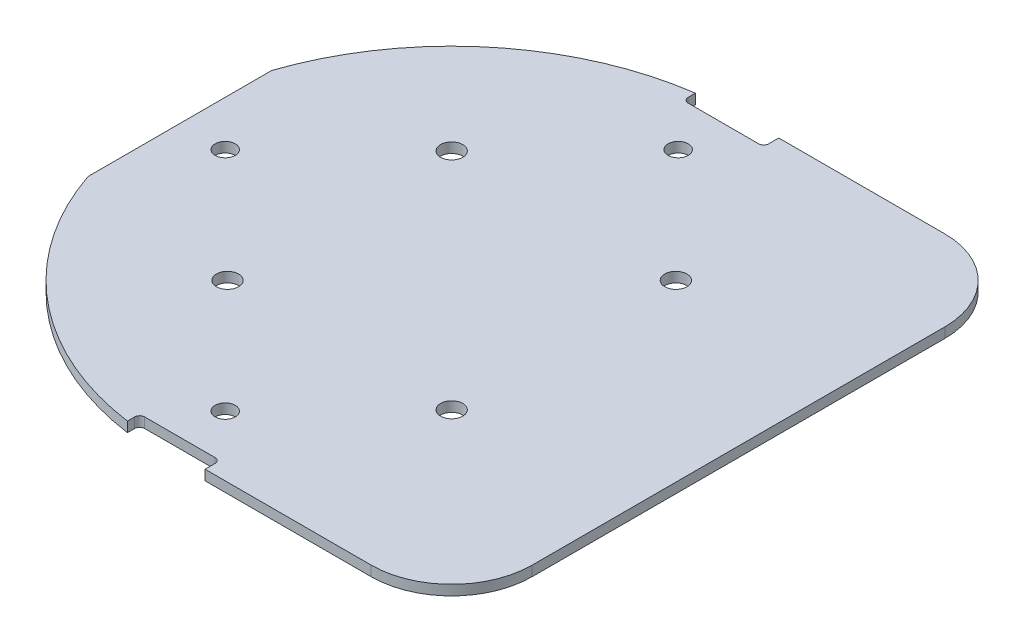
ISO-10303-21;
HEADER;
FILE_DESCRIPTION(('STEP AP214'),'2;1');
FILE_NAME('part.step','',(''),(''),'','','');
FILE_SCHEMA(('AUTOMOTIVE_DESIGN { 1 0 10303 214 1 1 1 1 }'));
ENDSEC;
DATA;
#1=APPLICATION_CONTEXT('core data for automotive mechanical design processes');
#2=APPLICATION_PROTOCOL_DEFINITION('international standard','automotive_design',2000,#1);
#3=PRODUCT_CONTEXT('',#1,'mechanical');
#4=PRODUCT('Part','Part','',(#3));
#5=PRODUCT_RELATED_PRODUCT_CATEGORY('part','',(#4));
#6=PRODUCT_DEFINITION_FORMATION('','',#4);
#7=PRODUCT_DEFINITION_CONTEXT('part definition',#1,'design');
#8=PRODUCT_DEFINITION('design','',#6,#7);
#9=PRODUCT_DEFINITION_SHAPE('','',#8);
#10=(LENGTH_UNIT() NAMED_UNIT(*) SI_UNIT(.MILLI.,.METRE.));
#11=(NAMED_UNIT(*) PLANE_ANGLE_UNIT() SI_UNIT($,.RADIAN.));
#12=(NAMED_UNIT(*) SI_UNIT($,.STERADIAN.) SOLID_ANGLE_UNIT());
#13=UNCERTAINTY_MEASURE_WITH_UNIT(LENGTH_MEASURE(1.E-05),#10,'distance_accuracy_value','');
#14=(GEOMETRIC_REPRESENTATION_CONTEXT(3) GLOBAL_UNCERTAINTY_ASSIGNED_CONTEXT((#13)) GLOBAL_UNIT_ASSIGNED_CONTEXT((#10,
#11,#12)) REPRESENTATION_CONTEXT('',''));
#15=CARTESIAN_POINT('',(0.,0.,0.));
#16=DIRECTION('',(0.,0.,1.));
#17=DIRECTION('',(1.,0.,0.));
#18=AXIS2_PLACEMENT_3D('',#15,#16,#17);
#19=CARTESIAN_POINT('',(0.,1.,28.5));
#20=DIRECTION('',(0.,0.,-1.));
#21=DIRECTION('',(-1.,0.,0.));
#22=AXIS2_PLACEMENT_3D('',#19,#20,#21);
#23=PLANE('',#22);
#24=DIRECTION('',(1.,0.,0.));
#25=VECTOR('',#24,1.);
#26=CARTESIAN_POINT('',(0.,0.,28.5));
#27=LINE('',#26,#25);
#28=CARTESIAN_POINT('',(20.5,0.,28.5));
#29=VERTEX_POINT('',#28);
#30=CARTESIAN_POINT('',(4.,0.,28.5));
#31=VERTEX_POINT('',#30);
#32=EDGE_CURVE('E282',#29,#31,#27,.F.);
#33=ORIENTED_EDGE('',*,*,#32,.F.);
#34=DIRECTION('',(0.,-1.,0.));
#35=VECTOR('',#34,1.);
#36=CARTESIAN_POINT('',(20.5,0.5,28.5));
#37=LINE('',#36,#35);
#38=CARTESIAN_POINT('',(20.5,1.,28.5));
#39=VERTEX_POINT('',#38);
#40=EDGE_CURVE('E134',#39,#29,#37,.T.);
#41=ORIENTED_EDGE('',*,*,#40,.F.);
#42=DIRECTION('',(1.,0.,0.));
#43=VECTOR('',#42,1.);
#44=CARTESIAN_POINT('',(0.,1.,28.5));
#45=LINE('',#44,#43);
#46=CARTESIAN_POINT('',(4.,1.,28.5));
#47=VERTEX_POINT('',#46);
#48=EDGE_CURVE('E183',#47,#39,#45,.T.);
#49=ORIENTED_EDGE('',*,*,#48,.F.);
#50=DIRECTION('',(0.,1.,0.));
#51=VECTOR('',#50,1.);
#52=CARTESIAN_POINT('',(4.,-0.001,28.5));
#53=LINE('',#52,#51);
#54=EDGE_CURVE('E140',#31,#47,#53,.T.);
#55=ORIENTED_EDGE('',*,*,#54,.F.);
#56=EDGE_LOOP('',(#33,#41,#49,#55));
#57=FACE_BOUND('',#56,.T.);
#58=ADVANCED_FACE('F17',(#57),#23,.F.);
#59=CARTESIAN_POINT('',(4.,-0.001,27.));
#60=DIRECTION('',(1.,0.,0.));
#61=DIRECTION('',(0.,0.,-1.));
#62=AXIS2_PLACEMENT_3D('',#59,#60,#61);
#63=PLANE('',#62);
#64=DIRECTION('',(0.,0.,1.));
#65=VECTOR('',#64,1.);
#66=CARTESIAN_POINT('',(4.,0.,0.));
#67=LINE('',#66,#65);
#68=CARTESIAN_POINT('',(4.,0.,27.5));
#69=VERTEX_POINT('',#68);
#70=EDGE_CURVE('E278',#31,#69,#67,.F.);
#71=ORIENTED_EDGE('',*,*,#70,.F.);
#72=ORIENTED_EDGE('',*,*,#54,.T.);
#73=DIRECTION('',(0.,0.,1.));
#74=VECTOR('',#73,1.);
#75=CARTESIAN_POINT('',(4.,1.,0.));
#76=LINE('',#75,#74);
#77=CARTESIAN_POINT('',(4.,1.,27.5));
#78=VERTEX_POINT('',#77);
#79=EDGE_CURVE('E186',#78,#47,#76,.T.);
#80=ORIENTED_EDGE('',*,*,#79,.F.);
#81=DIRECTION('',(0.,1.,0.));
#82=VECTOR('',#81,1.);
#83=CARTESIAN_POINT('',(4.,0.5,27.5));
#84=LINE('',#83,#82);
#85=EDGE_CURVE('E221',#69,#78,#84,.T.);
#86=ORIENTED_EDGE('',*,*,#85,.F.);
#87=EDGE_LOOP('',(#71,#72,#80,#86));
#88=FACE_BOUND('',#87,.T.);
#89=ADVANCED_FACE('F617',(#88),#63,.F.);
#90=CARTESIAN_POINT('',(3.5,1.,27.5));
#91=DIRECTION('',(0.,-1.,0.));
#92=DIRECTION('',(0.,0.,-1.));
#93=AXIS2_PLACEMENT_3D('',#90,#91,#92);
#94=CYLINDRICAL_SURFACE('',#93,0.5);
#95=CARTESIAN_POINT('',(3.5,1.,27.5));
#96=DIRECTION('',(0.,-1.,0.));
#97=DIRECTION('',(0.,0.,-1.));
#98=AXIS2_PLACEMENT_3D('',#95,#96,#97);
#99=CIRCLE('',#98,0.5);
#100=CARTESIAN_POINT('',(3.5,1.,27.));
#101=VERTEX_POINT('',#100);
#102=EDGE_CURVE('E298',#101,#78,#99,.T.);
#103=ORIENTED_EDGE('',*,*,#102,.F.);
#104=DIRECTION('',(0.,1.,0.));
#105=VECTOR('',#104,1.);
#106=CARTESIAN_POINT('',(3.5,-0.001,27.));
#107=LINE('',#106,#105);
#108=CARTESIAN_POINT('',(3.5,0.,27.));
#109=VERTEX_POINT('',#108);
#110=EDGE_CURVE('E219',#109,#101,#107,.T.);
#111=ORIENTED_EDGE('',*,*,#110,.F.);
#112=CARTESIAN_POINT('',(3.5,0.,27.5));
#113=DIRECTION('',(0.,-1.,0.));
#114=DIRECTION('',(0.,0.,-1.));
#115=AXIS2_PLACEMENT_3D('',#112,#113,#114);
#116=CIRCLE('',#115,0.5);
#117=EDGE_CURVE('E275',#69,#109,#116,.F.);
#118=ORIENTED_EDGE('',*,*,#117,.F.);
#119=ORIENTED_EDGE('',*,*,#85,.T.);
#120=EDGE_LOOP('',(#103,#111,#118,#119));
#121=FACE_BOUND('',#120,.T.);
#122=ADVANCED_FACE('F608',(#121),#94,.F.);
#123=CARTESIAN_POINT('',(-4.,-0.001,27.));
#124=DIRECTION('',(0.,0.,-1.));
#125=DIRECTION('',(-1.,0.,0.));
#126=AXIS2_PLACEMENT_3D('',#123,#124,#125);
#127=PLANE('',#126);
#128=DIRECTION('',(1.,0.,0.));
#129=VECTOR('',#128,1.);
#130=CARTESIAN_POINT('',(0.,1.,27.));
#131=LINE('',#130,#129);
#132=CARTESIAN_POINT('',(-3.5,1.,27.));
#133=VERTEX_POINT('',#132);
#134=EDGE_CURVE('E301',#133,#101,#131,.T.);
#135=ORIENTED_EDGE('',*,*,#134,.F.);
#136=DIRECTION('',(0.,1.,0.));
#137=VECTOR('',#136,1.);
#138=CARTESIAN_POINT('',(-3.5,0.5,27.));
#139=LINE('',#138,#137);
#140=CARTESIAN_POINT('',(-3.5,0.,27.));
#141=VERTEX_POINT('',#140);
#142=EDGE_CURVE('E217',#141,#133,#139,.T.);
#143=ORIENTED_EDGE('',*,*,#142,.F.);
#144=DIRECTION('',(1.,0.,0.));
#145=VECTOR('',#144,1.);
#146=CARTESIAN_POINT('',(0.,0.,27.));
#147=LINE('',#146,#145);
#148=EDGE_CURVE('E274',#109,#141,#147,.F.);
#149=ORIENTED_EDGE('',*,*,#148,.F.);
#150=ORIENTED_EDGE('',*,*,#110,.T.);
#151=EDGE_LOOP('',(#135,#143,#149,#150));
#152=FACE_BOUND('',#151,.T.);
#153=ADVANCED_FACE('F599',(#152),#127,.F.);
#154=CARTESIAN_POINT('',(-3.5,1.,27.5));
#155=DIRECTION('',(0.,-1.,0.));
#156=DIRECTION('',(0.,0.,-1.));
#157=AXIS2_PLACEMENT_3D('',#154,#155,#156);
#158=CYLINDRICAL_SURFACE('',#157,0.5);
#159=CARTESIAN_POINT('',(-3.5,1.,27.5));
#160=DIRECTION('',(0.,-1.,0.));
#161=DIRECTION('',(0.,0.,-1.));
#162=AXIS2_PLACEMENT_3D('',#159,#160,#161);
#163=CIRCLE('',#162,0.5);
#164=CARTESIAN_POINT('',(-4.,1.,27.5));
#165=VERTEX_POINT('',#164);
#166=EDGE_CURVE('E302',#165,#133,#163,.T.);
#167=ORIENTED_EDGE('',*,*,#166,.F.);
#168=DIRECTION('',(0.,1.,0.));
#169=VECTOR('',#168,1.);
#170=CARTESIAN_POINT('',(-4.,-0.001,27.5));
#171=LINE('',#170,#169);
#172=CARTESIAN_POINT('',(-4.,0.,27.5));
#173=VERTEX_POINT('',#172);
#174=EDGE_CURVE('E215',#173,#165,#171,.T.);
#175=ORIENTED_EDGE('',*,*,#174,.F.);
#176=CARTESIAN_POINT('',(-3.5,0.,27.5));
#177=DIRECTION('',(0.,-1.,0.));
#178=DIRECTION('',(0.,0.,-1.));
#179=AXIS2_PLACEMENT_3D('',#176,#177,#178);
#180=CIRCLE('',#179,0.5);
#181=EDGE_CURVE('E271',#141,#173,#180,.F.);
#182=ORIENTED_EDGE('',*,*,#181,.F.);
#183=ORIENTED_EDGE('',*,*,#142,.T.);
#184=EDGE_LOOP('',(#167,#175,#182,#183));
#185=FACE_BOUND('',#184,.T.);
#186=ADVANCED_FACE('F590',(#185),#158,.F.);
#187=CARTESIAN_POINT('',(-4.,-0.001,27.));
#188=DIRECTION('',(-1.,0.,0.));
#189=DIRECTION('',(0.,0.,1.));
#190=AXIS2_PLACEMENT_3D('',#187,#188,#189);
#191=PLANE('',#190);
#192=DIRECTION('',(0.,0.,1.));
#193=VECTOR('',#192,1.);
#194=CARTESIAN_POINT('',(-4.,1.,0.));
#195=LINE('',#194,#193);
#196=CARTESIAN_POINT('',(-4.00000000000312,1.,28.2179021190445));
#197=VERTEX_POINT('',#196);
#198=EDGE_CURVE('E305',#197,#165,#195,.F.);
#199=ORIENTED_EDGE('',*,*,#198,.F.);
#200=DIRECTION('',(0.,1.,0.));
#201=VECTOR('',#200,1.);
#202=CARTESIAN_POINT('',(-4.00000000000623,0.5,28.217902119044));
#203=LINE('',#202,#201);
#204=CARTESIAN_POINT('',(-4.00000000000312,0.,28.2179021190445));
#205=VERTEX_POINT('',#204);
#206=EDGE_CURVE('E213',#205,#197,#203,.T.);
#207=ORIENTED_EDGE('',*,*,#206,.F.);
#208=DIRECTION('',(0.,0.,1.));
#209=VECTOR('',#208,1.);
#210=CARTESIAN_POINT('',(-4.,0.,0.));
#211=LINE('',#210,#209);
#212=EDGE_CURVE('E270',#173,#205,#211,.T.);
#213=ORIENTED_EDGE('',*,*,#212,.F.);
#214=ORIENTED_EDGE('',*,*,#174,.T.);
#215=EDGE_LOOP('',(#199,#207,#213,#214));
#216=FACE_BOUND('',#215,.T.);
#217=ADVANCED_FACE('F581',(#216),#191,.F.);
#218=CARTESIAN_POINT('',(0.,0.,0.));
#219=DIRECTION('',(0.,-1.,0.));
#220=DIRECTION('',(0.,0.,-1.));
#221=AXIS2_PLACEMENT_3D('',#218,#219,#220);
#222=CYLINDRICAL_SURFACE('',#221,28.5);
#223=CARTESIAN_POINT('',(0.,1.,0.));
#224=DIRECTION('',(0.,-1.,0.));
#225=DIRECTION('',(0.,0.,-1.));
#226=AXIS2_PLACEMENT_3D('',#223,#224,#225);
#227=CIRCLE('',#226,28.5);
#228=CARTESIAN_POINT('',(-27.,1.,9.12414379522367));
#229=VERTEX_POINT('',#228);
#230=EDGE_CURVE('E306',#229,#197,#227,.F.);
#231=ORIENTED_EDGE('',*,*,#230,.F.);
#232=DIRECTION('',(0.,1.,0.));
#233=VECTOR('',#232,1.);
#234=CARTESIAN_POINT('',(-27.,-0.001,9.124143795));
#235=LINE('',#234,#233);
#236=CARTESIAN_POINT('',(-27.,0.,9.12414379522367));
#237=VERTEX_POINT('',#236);
#238=EDGE_CURVE('E211',#237,#229,#235,.T.);
#239=ORIENTED_EDGE('',*,*,#238,.F.);
#240=CARTESIAN_POINT('',(0.,0.,0.));
#241=DIRECTION('',(0.,-1.,0.));
#242=DIRECTION('',(0.,0.,-1.));
#243=AXIS2_PLACEMENT_3D('',#240,#241,#242);
#244=CIRCLE('',#243,28.5);
#245=EDGE_CURVE('E267',#205,#237,#244,.T.);
#246=ORIENTED_EDGE('',*,*,#245,.F.);
#247=ORIENTED_EDGE('',*,*,#206,.T.);
#248=EDGE_LOOP('',(#231,#239,#246,#247));
#249=FACE_BOUND('',#248,.T.);
#250=ADVANCED_FACE('F572',(#249),#222,.T.);
#251=CARTESIAN_POINT('',(-27.,-0.001,-21.489350573));
#252=DIRECTION('',(1.,0.,0.));
#253=DIRECTION('',(0.,0.,-1.));
#254=AXIS2_PLACEMENT_3D('',#251,#252,#253);
#255=PLANE('',#254);
#256=DIRECTION('',(0.,1.,0.));
#257=VECTOR('',#256,1.);
#258=CARTESIAN_POINT('',(-27.0000000001357,0.5,-9.12414379504583));
#259=LINE('',#258,#257);
#260=CARTESIAN_POINT('',(-27.0000000000678,0.,-9.12414379524658));
#261=VERTEX_POINT('',#260);
#262=CARTESIAN_POINT('',(-27.0000000000678,1.,-9.12414379524658));
#263=VERTEX_POINT('',#262);
#264=EDGE_CURVE('E209',#261,#263,#259,.T.);
#265=ORIENTED_EDGE('',*,*,#264,.F.);
#266=DIRECTION('',(0.,0.,1.));
#267=VECTOR('',#266,1.);
#268=CARTESIAN_POINT('',(-27.,0.,0.));
#269=LINE('',#268,#267);
#270=EDGE_CURVE('E266',#237,#261,#269,.F.);
#271=ORIENTED_EDGE('',*,*,#270,.F.);
#272=ORIENTED_EDGE('',*,*,#238,.T.);
#273=DIRECTION('',(0.,0.,1.));
#274=VECTOR('',#273,1.);
#275=CARTESIAN_POINT('',(-27.,1.,0.));
#276=LINE('',#275,#274);
#277=EDGE_CURVE('E309',#263,#229,#276,.T.);
#278=ORIENTED_EDGE('',*,*,#277,.F.);
#279=EDGE_LOOP('',(#265,#271,#272,#278));
#280=FACE_BOUND('',#279,.T.);
#281=ADVANCED_FACE('F563',(#280),#255,.F.);
#282=CARTESIAN_POINT('',(0.,0.,0.));
#283=DIRECTION('',(0.,-1.,0.));
#284=DIRECTION('',(0.,0.,-1.));
#285=AXIS2_PLACEMENT_3D('',#282,#283,#284);
#286=CYLINDRICAL_SURFACE('',#285,28.5);
#287=CARTESIAN_POINT('',(0.,0.,0.));
#288=DIRECTION('',(0.,-1.,0.));
#289=DIRECTION('',(0.,0.,-1.));
#290=AXIS2_PLACEMENT_3D('',#287,#288,#289);
#291=CIRCLE('',#290,28.5);
#292=CARTESIAN_POINT('',(-4.,0.,-28.2179021190225));
#293=VERTEX_POINT('',#292);
#294=EDGE_CURVE('E263',#261,#293,#291,.T.);
#295=ORIENTED_EDGE('',*,*,#294,.F.);
#296=ORIENTED_EDGE('',*,*,#264,.T.);
#297=CARTESIAN_POINT('',(0.,1.,0.));
#298=DIRECTION('',(0.,-1.,0.));
#299=DIRECTION('',(0.,0.,-1.));
#300=AXIS2_PLACEMENT_3D('',#297,#298,#299);
#301=CIRCLE('',#300,28.5);
#302=CARTESIAN_POINT('',(-4.,1.,-28.2179021190225));
#303=VERTEX_POINT('',#302);
#304=EDGE_CURVE('E310',#303,#263,#301,.F.);
#305=ORIENTED_EDGE('',*,*,#304,.F.);
#306=DIRECTION('',(0.,1.,0.));
#307=VECTOR('',#306,1.);
#308=CARTESIAN_POINT('',(-4.,-0.001,-28.217902119));
#309=LINE('',#308,#307);
#310=EDGE_CURVE('E207',#293,#303,#309,.T.);
#311=ORIENTED_EDGE('',*,*,#310,.F.);
#312=EDGE_LOOP('',(#295,#296,#305,#311));
#313=FACE_BOUND('',#312,.T.);
#314=ADVANCED_FACE('F554',(#313),#286,.T.);
#315=CARTESIAN_POINT('',(-4.,-0.001,-27.));
#316=DIRECTION('',(-1.,0.,0.));
#317=DIRECTION('',(0.,0.,1.));
#318=AXIS2_PLACEMENT_3D('',#315,#316,#317);
#319=PLANE('',#318);
#320=DIRECTION('',(0.,0.,1.));
#321=VECTOR('',#320,1.);
#322=CARTESIAN_POINT('',(-4.,0.,0.));
#323=LINE('',#322,#321);
#324=CARTESIAN_POINT('',(-4.,0.,-27.5));
#325=VERTEX_POINT('',#324);
#326=EDGE_CURVE('E262',#293,#325,#323,.T.);
#327=ORIENTED_EDGE('',*,*,#326,.F.);
#328=ORIENTED_EDGE('',*,*,#310,.T.);
#329=DIRECTION('',(0.,0.,1.));
#330=VECTOR('',#329,1.);
#331=CARTESIAN_POINT('',(-4.,1.,0.));
#332=LINE('',#331,#330);
#333=CARTESIAN_POINT('',(-4.,1.,-27.5));
#334=VERTEX_POINT('',#333);
#335=EDGE_CURVE('E313',#334,#303,#332,.F.);
#336=ORIENTED_EDGE('',*,*,#335,.F.);
#337=DIRECTION('',(0.,1.,0.));
#338=VECTOR('',#337,1.);
#339=CARTESIAN_POINT('',(-4.,0.5,-27.5));
#340=LINE('',#339,#338);
#341=EDGE_CURVE('E205',#325,#334,#340,.T.);
#342=ORIENTED_EDGE('',*,*,#341,.F.);
#343=EDGE_LOOP('',(#327,#328,#336,#342));
#344=FACE_BOUND('',#343,.T.);
#345=ADVANCED_FACE('F545',(#344),#319,.F.);
#346=CARTESIAN_POINT('',(-3.5,1.,-27.5));
#347=DIRECTION('',(0.,-1.,0.));
#348=DIRECTION('',(0.,0.,-1.));
#349=AXIS2_PLACEMENT_3D('',#346,#347,#348);
#350=CYLINDRICAL_SURFACE('',#349,0.5);
#351=CARTESIAN_POINT('',(-3.5,1.,-27.5));
#352=DIRECTION('',(0.,-1.,0.));
#353=DIRECTION('',(0.,0.,-1.));
#354=AXIS2_PLACEMENT_3D('',#351,#352,#353);
#355=CIRCLE('',#354,0.5);
#356=CARTESIAN_POINT('',(-3.5,1.,-27.));
#357=VERTEX_POINT('',#356);
#358=EDGE_CURVE('E314',#357,#334,#355,.T.);
#359=ORIENTED_EDGE('',*,*,#358,.F.);
#360=DIRECTION('',(0.,1.,0.));
#361=VECTOR('',#360,1.);
#362=CARTESIAN_POINT('',(-3.5,-0.001,-27.));
#363=LINE('',#362,#361);
#364=CARTESIAN_POINT('',(-3.5,0.,-27.));
#365=VERTEX_POINT('',#364);
#366=EDGE_CURVE('E203',#365,#357,#363,.T.);
#367=ORIENTED_EDGE('',*,*,#366,.F.);
#368=CARTESIAN_POINT('',(-3.5,0.,-27.5));
#369=DIRECTION('',(0.,-1.,0.));
#370=DIRECTION('',(0.,0.,-1.));
#371=AXIS2_PLACEMENT_3D('',#368,#369,#370);
#372=CIRCLE('',#371,0.5);
#373=EDGE_CURVE('E259',#325,#365,#372,.F.);
#374=ORIENTED_EDGE('',*,*,#373,.F.);
#375=ORIENTED_EDGE('',*,*,#341,.T.);
#376=EDGE_LOOP('',(#359,#367,#374,#375));
#377=FACE_BOUND('',#376,.T.);
#378=ADVANCED_FACE('F536',(#377),#350,.F.);
#379=CARTESIAN_POINT('',(-4.,-0.001,-27.));
#380=DIRECTION('',(0.,0.,1.));
#381=DIRECTION('',(1.,0.,0.));
#382=AXIS2_PLACEMENT_3D('',#379,#380,#381);
#383=PLANE('',#382);
#384=DIRECTION('',(1.,0.,0.));
#385=VECTOR('',#384,1.);
#386=CARTESIAN_POINT('',(0.,1.,-27.));
#387=LINE('',#386,#385);
#388=CARTESIAN_POINT('',(3.5,1.,-27.));
#389=VERTEX_POINT('',#388);
#390=EDGE_CURVE('E317',#389,#357,#387,.F.);
#391=ORIENTED_EDGE('',*,*,#390,.F.);
#392=DIRECTION('',(0.,1.,0.));
#393=VECTOR('',#392,1.);
#394=CARTESIAN_POINT('',(3.5,0.5,-27.));
#395=LINE('',#394,#393);
#396=CARTESIAN_POINT('',(3.5,0.,-27.));
#397=VERTEX_POINT('',#396);
#398=EDGE_CURVE('E201',#397,#389,#395,.T.);
#399=ORIENTED_EDGE('',*,*,#398,.F.);
#400=DIRECTION('',(1.,0.,0.));
#401=VECTOR('',#400,1.);
#402=CARTESIAN_POINT('',(0.,0.,-27.));
#403=LINE('',#402,#401);
#404=EDGE_CURVE('E258',#365,#397,#403,.T.);
#405=ORIENTED_EDGE('',*,*,#404,.F.);
#406=ORIENTED_EDGE('',*,*,#366,.T.);
#407=EDGE_LOOP('',(#391,#399,#405,#406));
#408=FACE_BOUND('',#407,.T.);
#409=ADVANCED_FACE('F527',(#408),#383,.F.);
#410=CARTESIAN_POINT('',(3.5,1.,-27.5));
#411=DIRECTION('',(0.,-1.,0.));
#412=DIRECTION('',(0.,0.,-1.));
#413=AXIS2_PLACEMENT_3D('',#410,#411,#412);
#414=CYLINDRICAL_SURFACE('',#413,0.5);
#415=CARTESIAN_POINT('',(3.5,1.,-27.5));
#416=DIRECTION('',(0.,-1.,0.));
#417=DIRECTION('',(0.,0.,-1.));
#418=AXIS2_PLACEMENT_3D('',#415,#416,#417);
#419=CIRCLE('',#418,0.5);
#420=CARTESIAN_POINT('',(4.,1.,-27.5));
#421=VERTEX_POINT('',#420);
#422=EDGE_CURVE('E168',#421,#389,#419,.T.);
#423=ORIENTED_EDGE('',*,*,#422,.F.);
#424=DIRECTION('',(0.,1.,0.));
#425=VECTOR('',#424,1.);
#426=CARTESIAN_POINT('',(4.,-0.001,-27.5));
#427=LINE('',#426,#425);
#428=CARTESIAN_POINT('',(4.,0.,-27.5));
#429=VERTEX_POINT('',#428);
#430=EDGE_CURVE('E160',#429,#421,#427,.T.);
#431=ORIENTED_EDGE('',*,*,#430,.F.);
#432=CARTESIAN_POINT('',(3.5,0.,-27.5));
#433=DIRECTION('',(0.,-1.,0.));
#434=DIRECTION('',(0.,0.,-1.));
#435=AXIS2_PLACEMENT_3D('',#432,#433,#434);
#436=CIRCLE('',#435,0.5);
#437=EDGE_CURVE('E254',#397,#429,#436,.F.);
#438=ORIENTED_EDGE('',*,*,#437,.F.);
#439=ORIENTED_EDGE('',*,*,#398,.T.);
#440=EDGE_LOOP('',(#423,#431,#438,#439));
#441=FACE_BOUND('',#440,.T.);
#442=ADVANCED_FACE('F519',(#441),#414,.F.);
#443=CARTESIAN_POINT('',(4.,-0.001,-27.));
#444=DIRECTION('',(1.,0.,0.));
#445=DIRECTION('',(0.,0.,-1.));
#446=AXIS2_PLACEMENT_3D('',#443,#444,#445);
#447=PLANE('',#446);
#448=DIRECTION('',(0.,0.,1.));
#449=VECTOR('',#448,1.);
#450=CARTESIAN_POINT('',(4.,1.,0.));
#451=LINE('',#450,#449);
#452=CARTESIAN_POINT('',(4.,1.,-28.5));
#453=VERTEX_POINT('',#452);
#454=EDGE_CURVE('E163',#453,#421,#451,.T.);
#455=ORIENTED_EDGE('',*,*,#454,.F.);
#456=DIRECTION('',(0.,1.,0.));
#457=VECTOR('',#456,1.);
#458=CARTESIAN_POINT('',(4.,1.,-28.5));
#459=LINE('',#458,#457);
#460=CARTESIAN_POINT('',(4.,0.,-28.5));
#461=VERTEX_POINT('',#460);
#462=EDGE_CURVE('E148',#461,#453,#459,.T.);
#463=ORIENTED_EDGE('',*,*,#462,.F.);
#464=DIRECTION('',(0.,0.,1.));
#465=VECTOR('',#464,1.);
#466=CARTESIAN_POINT('',(4.,0.,0.));
#467=LINE('',#466,#465);
#468=EDGE_CURVE('E257',#429,#461,#467,.F.);
#469=ORIENTED_EDGE('',*,*,#468,.F.);
#470=ORIENTED_EDGE('',*,*,#430,.T.);
#471=EDGE_LOOP('',(#455,#463,#469,#470));
#472=FACE_BOUND('',#471,.T.);
#473=ADVANCED_FACE('F164',(#472),#447,.F.);
#474=CARTESIAN_POINT('',(0.,1.,-28.5));
#475=DIRECTION('',(0.,0.,1.));
#476=DIRECTION('',(1.,0.,0.));
#477=AXIS2_PLACEMENT_3D('',#474,#475,#476);
#478=PLANE('',#477);
#479=DIRECTION('',(1.,0.,0.));
#480=VECTOR('',#479,1.);
#481=CARTESIAN_POINT('',(0.,1.,-28.5));
#482=LINE('',#481,#480);
#483=CARTESIAN_POINT('',(20.5,1.,-28.5));
#484=VERTEX_POINT('',#483);
#485=EDGE_CURVE('E152',#484,#453,#482,.F.);
#486=ORIENTED_EDGE('',*,*,#485,.F.);
#487=DIRECTION('',(0.,1.,0.));
#488=VECTOR('',#487,1.);
#489=CARTESIAN_POINT('',(20.5,0.5,-28.5));
#490=LINE('',#489,#488);
#491=CARTESIAN_POINT('',(20.5,0.,-28.5));
#492=VERTEX_POINT('',#491);
#493=EDGE_CURVE('E159',#492,#484,#490,.T.);
#494=ORIENTED_EDGE('',*,*,#493,.F.);
#495=DIRECTION('',(1.,0.,0.));
#496=VECTOR('',#495,1.);
#497=CARTESIAN_POINT('',(0.,0.,-28.5));
#498=LINE('',#497,#496);
#499=EDGE_CURVE('E155',#461,#492,#498,.T.);
#500=ORIENTED_EDGE('',*,*,#499,.F.);
#501=ORIENTED_EDGE('',*,*,#462,.T.);
#502=EDGE_LOOP('',(#486,#494,#500,#501));
#503=FACE_BOUND('',#502,.T.);
#504=ADVANCED_FACE('F150',(#503),#478,.F.);
#505=CARTESIAN_POINT('',(20.5,0.,-20.5));
#506=DIRECTION('',(0.,-1.,0.));
#507=DIRECTION('',(0.,0.,-1.));
#508=AXIS2_PLACEMENT_3D('',#505,#506,#507);
#509=CYLINDRICAL_SURFACE('',#508,8.);
#510=CARTESIAN_POINT('',(20.5,1.,-20.5));
#511=DIRECTION('',(0.,-1.,0.));
#512=DIRECTION('',(0.,0.,-1.));
#513=AXIS2_PLACEMENT_3D('',#510,#511,#512);
#514=CIRCLE('',#513,8.);
#515=CARTESIAN_POINT('',(28.5,1.,-20.5));
#516=VERTEX_POINT('',#515);
#517=EDGE_CURVE('E174',#516,#484,#514,.F.);
#518=ORIENTED_EDGE('',*,*,#517,.F.);
#519=DIRECTION('',(0.,1.,0.));
#520=VECTOR('',#519,1.);
#521=CARTESIAN_POINT('',(28.5,1.,-20.5));
#522=LINE('',#521,#520);
#523=CARTESIAN_POINT('',(28.5,0.,-20.5));
#524=VERTEX_POINT('',#523);
#525=EDGE_CURVE('E195',#524,#516,#522,.T.);
#526=ORIENTED_EDGE('',*,*,#525,.F.);
#527=CARTESIAN_POINT('',(20.5,0.,-20.5));
#528=DIRECTION('',(0.,-1.,0.));
#529=DIRECTION('',(0.,0.,-1.));
#530=AXIS2_PLACEMENT_3D('',#527,#528,#529);
#531=CIRCLE('',#530,8.);
#532=EDGE_CURVE('E251',#492,#524,#531,.T.);
#533=ORIENTED_EDGE('',*,*,#532,.F.);
#534=ORIENTED_EDGE('',*,*,#493,.T.);
#535=EDGE_LOOP('',(#518,#526,#533,#534));
#536=FACE_BOUND('',#535,.T.);
#537=ADVANCED_FACE('F360',(#536),#509,.T.);
#538=CARTESIAN_POINT('',(28.5,1.,-20.5));
#539=DIRECTION('',(-1.,0.,0.));
#540=DIRECTION('',(0.,0.,1.));
#541=AXIS2_PLACEMENT_3D('',#538,#539,#540);
#542=PLANE('',#541);
#543=DIRECTION('',(0.,0.,1.));
#544=VECTOR('',#543,1.);
#545=CARTESIAN_POINT('',(28.5,1.,0.));
#546=LINE('',#545,#544);
#547=CARTESIAN_POINT('',(28.5,1.,20.5));
#548=VERTEX_POINT('',#547);
#549=EDGE_CURVE('E176',#548,#516,#546,.F.);
#550=ORIENTED_EDGE('',*,*,#549,.F.);
#551=DIRECTION('',(0.,1.,0.));
#552=VECTOR('',#551,1.);
#553=CARTESIAN_POINT('',(28.5,0.5,20.5));
#554=LINE('',#553,#552);
#555=CARTESIAN_POINT('',(28.5,0.,20.5));
#556=VERTEX_POINT('',#555);
#557=EDGE_CURVE('E35',#556,#548,#554,.T.);
#558=ORIENTED_EDGE('',*,*,#557,.F.);
#559=DIRECTION('',(0.,0.,1.));
#560=VECTOR('',#559,1.);
#561=CARTESIAN_POINT('',(28.5,0.,0.));
#562=LINE('',#561,#560);
#563=EDGE_CURVE('E250',#524,#556,#562,.T.);
#564=ORIENTED_EDGE('',*,*,#563,.F.);
#565=ORIENTED_EDGE('',*,*,#525,.T.);
#566=EDGE_LOOP('',(#550,#558,#564,#565));
#567=FACE_BOUND('',#566,.T.);
#568=ADVANCED_FACE('F357',(#567),#542,.F.);
#569=CARTESIAN_POINT('',(20.5,0.,20.5));
#570=DIRECTION('',(0.,-1.,0.));
#571=DIRECTION('',(0.,0.,-1.));
#572=AXIS2_PLACEMENT_3D('',#569,#570,#571);
#573=CYLINDRICAL_SURFACE('',#572,8.);
#574=CARTESIAN_POINT('',(20.5,1.,20.5));
#575=DIRECTION('',(0.,-1.,0.));
#576=DIRECTION('',(0.,0.,-1.));
#577=AXIS2_PLACEMENT_3D('',#574,#575,#576);
#578=CIRCLE('',#577,8.);
#579=EDGE_CURVE('E20',#39,#548,#578,.F.);
#580=ORIENTED_EDGE('',*,*,#579,.F.);
#581=ORIENTED_EDGE('',*,*,#40,.T.);
#582=CARTESIAN_POINT('',(20.5,0.,20.5));
#583=DIRECTION('',(0.,-1.,0.));
#584=DIRECTION('',(0.,0.,-1.));
#585=AXIS2_PLACEMENT_3D('',#582,#583,#584);
#586=CIRCLE('',#585,8.);
#587=EDGE_CURVE('E247',#556,#29,#586,.T.);
#588=ORIENTED_EDGE('',*,*,#587,.F.);
#589=ORIENTED_EDGE('',*,*,#557,.T.);
#590=EDGE_LOOP('',(#580,#581,#588,#589));
#591=FACE_BOUND('',#590,.T.);
#592=ADVANCED_FACE('F362',(#591),#573,.T.);
#593=CARTESIAN_POINT('',(-11.136931804,1.,-11.136931804));
#594=DIRECTION('',(0.,-1.,0.));
#595=DIRECTION('',(0.,0.,-1.));
#596=AXIS2_PLACEMENT_3D('',#593,#594,#595);
#597=CYLINDRICAL_SURFACE('',#596,1.1);
#598=CARTESIAN_POINT('',(-11.136931804,0.9999999996881,-11.136931804));
#599=DIRECTION('',(0.,-1.,0.));
#600=DIRECTION('',(0.,0.,-1.));
#601=AXIS2_PLACEMENT_3D('',#598,#599,#600);
#602=CIRCLE('',#601,1.1);
#603=CARTESIAN_POINT('',(-11.136931804,0.9999999996881,-12.236931804));
#604=VERTEX_POINT('',#603);
#605=EDGE_CURVE('E286',#604,#604,#602,.T.);
#606=ORIENTED_EDGE('',*,*,#605,.F.);
#607=EDGE_LOOP('',(#606));
#608=FACE_BOUND('',#607,.T.);
#609=CARTESIAN_POINT('',(-11.136931804,-3.11899811533678E-10,-11.136931804));
#610=DIRECTION('',(0.,-1.,0.));
#611=DIRECTION('',(0.,0.,-1.));
#612=AXIS2_PLACEMENT_3D('',#609,#610,#611);
#613=CIRCLE('',#612,1.1);
#614=CARTESIAN_POINT('',(-11.136931804,-3.11899811533678E-10,-12.236931804));
#615=VERTEX_POINT('',#614);
#616=EDGE_CURVE('E244',#615,#615,#613,.F.);
#617=ORIENTED_EDGE('',*,*,#616,.F.);
#618=EDGE_LOOP('',(#617));
#619=FACE_BOUND('',#618,.T.);
#620=ADVANCED_FACE('F364',(#608,#619),#597,.F.);
#621=CARTESIAN_POINT('',(11.136931804,1.,-11.136931804));
#622=DIRECTION('',(0.,-1.,0.));
#623=DIRECTION('',(0.,0.,-1.));
#624=AXIS2_PLACEMENT_3D('',#621,#622,#623);
#625=CYLINDRICAL_SURFACE('',#624,1.1);
#626=CARTESIAN_POINT('',(11.136931804,0.9999999996881,-11.136931804));
#627=DIRECTION('',(0.,-1.,0.));
#628=DIRECTION('',(0.,0.,-1.));
#629=AXIS2_PLACEMENT_3D('',#626,#627,#628);
#630=CIRCLE('',#629,1.1);
#631=CARTESIAN_POINT('',(11.136931804,0.9999999996881,-12.236931804));
#632=VERTEX_POINT('',#631);
#633=EDGE_CURVE('E289',#632,#632,#630,.T.);
#634=ORIENTED_EDGE('',*,*,#633,.F.);
#635=EDGE_LOOP('',(#634));
#636=FACE_BOUND('',#635,.T.);
#637=CARTESIAN_POINT('',(11.136931804,-3.11899811533678E-10,-11.136931804));
#638=DIRECTION('',(0.,-1.,0.));
#639=DIRECTION('',(0.,0.,-1.));
#640=AXIS2_PLACEMENT_3D('',#637,#638,#639);
#641=CIRCLE('',#640,1.1);
#642=CARTESIAN_POINT('',(11.136931804,-3.11899811533678E-10,-12.236931804));
#643=VERTEX_POINT('',#642);
#644=EDGE_CURVE('E241',#643,#643,#641,.F.);
#645=ORIENTED_EDGE('',*,*,#644,.F.);
#646=EDGE_LOOP('',(#645));
#647=FACE_BOUND('',#646,.T.);
#648=ADVANCED_FACE('F371',(#636,#647),#625,.F.);
#649=CARTESIAN_POINT('',(11.136931804,1.,11.136931804));
#650=DIRECTION('',(0.,-1.,0.));
#651=DIRECTION('',(0.,0.,-1.));
#652=AXIS2_PLACEMENT_3D('',#649,#650,#651);
#653=CYLINDRICAL_SURFACE('',#652,1.1);
#654=CARTESIAN_POINT('',(11.136931804,1.0000000003119,11.136931804));
#655=DIRECTION('',(0.,-1.,0.));
#656=DIRECTION('',(0.,0.,-1.));
#657=AXIS2_PLACEMENT_3D('',#654,#655,#656);
#658=CIRCLE('',#657,1.1);
#659=CARTESIAN_POINT('',(11.136931804,1.0000000003119,10.036931804));
#660=VERTEX_POINT('',#659);
#661=EDGE_CURVE('E283',#660,#660,#658,.T.);
#662=ORIENTED_EDGE('',*,*,#661,.F.);
#663=EDGE_LOOP('',(#662));
#664=FACE_BOUND('',#663,.T.);
#665=CARTESIAN_POINT('',(11.136931804,3.11899811533678E-10,11.136931804));
#666=DIRECTION('',(0.,-1.,0.));
#667=DIRECTION('',(0.,0.,-1.));
#668=AXIS2_PLACEMENT_3D('',#665,#666,#667);
#669=CIRCLE('',#668,1.1);
#670=CARTESIAN_POINT('',(11.136931804,3.11899811533678E-10,10.036931804));
#671=VERTEX_POINT('',#670);
#672=EDGE_CURVE('E238',#671,#671,#669,.F.);
#673=ORIENTED_EDGE('',*,*,#672,.F.);
#674=EDGE_LOOP('',(#673));
#675=FACE_BOUND('',#674,.T.);
#676=ADVANCED_FACE('F400',(#664,#675),#653,.F.);
#677=CARTESIAN_POINT('',(0.,1.,-22.5));
#678=DIRECTION('',(0.,-1.,0.));
#679=DIRECTION('',(0.,0.,-1.));
#680=AXIS2_PLACEMENT_3D('',#677,#678,#679);
#681=CYLINDRICAL_SURFACE('',#680,1.);
#682=CARTESIAN_POINT('',(0.,1.,-22.5));
#683=DIRECTION('',(0.,-1.,0.));
#684=DIRECTION('',(0.,0.,-1.));
#685=AXIS2_PLACEMENT_3D('',#682,#683,#684);
#686=CIRCLE('',#685,1.);
#687=CARTESIAN_POINT('',(0.,1.,-23.5));
#688=VERTEX_POINT('',#687);
#689=EDGE_CURVE('E292',#688,#688,#686,.T.);
#690=ORIENTED_EDGE('',*,*,#689,.F.);
#691=EDGE_LOOP('',(#690));
#692=FACE_BOUND('',#691,.T.);
#693=CARTESIAN_POINT('',(0.,0.,-22.5));
#694=DIRECTION('',(0.,-1.,0.));
#695=DIRECTION('',(0.,0.,-1.));
#696=AXIS2_PLACEMENT_3D('',#693,#694,#695);
#697=CIRCLE('',#696,1.);
#698=CARTESIAN_POINT('',(0.,0.,-23.5));
#699=VERTEX_POINT('',#698);
#700=EDGE_CURVE('E235',#699,#699,#697,.F.);
#701=ORIENTED_EDGE('',*,*,#700,.F.);
#702=EDGE_LOOP('',(#701));
#703=FACE_BOUND('',#702,.T.);
#704=ADVANCED_FACE('F396',(#692,#703),#681,.F.);
#705=CARTESIAN_POINT('',(-11.136931804,1.,11.136931804));
#706=DIRECTION('',(0.,-1.,0.));
#707=DIRECTION('',(0.,0.,-1.));
#708=AXIS2_PLACEMENT_3D('',#705,#706,#707);
#709=CYLINDRICAL_SURFACE('',#708,1.1);
#710=CARTESIAN_POINT('',(-11.136931804,1.0000000003119,11.136931804));
#711=DIRECTION('',(0.,-1.,0.));
#712=DIRECTION('',(0.,0.,-1.));
#713=AXIS2_PLACEMENT_3D('',#710,#711,#712);
#714=CIRCLE('',#713,1.1);
#715=CARTESIAN_POINT('',(-11.136931804,1.0000000003119,10.036931804));
#716=VERTEX_POINT('',#715);
#717=EDGE_CURVE('E279',#716,#716,#714,.T.);
#718=ORIENTED_EDGE('',*,*,#717,.F.);
#719=EDGE_LOOP('',(#718));
#720=FACE_BOUND('',#719,.T.);
#721=CARTESIAN_POINT('',(-11.136931804,3.11899811533678E-10,11.136931804));
#722=DIRECTION('',(0.,-1.,0.));
#723=DIRECTION('',(0.,0.,-1.));
#724=AXIS2_PLACEMENT_3D('',#721,#722,#723);
#725=CIRCLE('',#724,1.1);
#726=CARTESIAN_POINT('',(-11.136931804,3.11899811533678E-10,10.036931804));
#727=VERTEX_POINT('',#726);
#728=EDGE_CURVE('E232',#727,#727,#725,.F.);
#729=ORIENTED_EDGE('',*,*,#728,.F.);
#730=EDGE_LOOP('',(#729));
#731=FACE_BOUND('',#730,.T.);
#732=ADVANCED_FACE('F392',(#720,#731),#709,.F.);
#733=CARTESIAN_POINT('',(0.,1.,22.5));
#734=DIRECTION('',(0.,-1.,0.));
#735=DIRECTION('',(0.,0.,-1.));
#736=AXIS2_PLACEMENT_3D('',#733,#734,#735);
#737=CYLINDRICAL_SURFACE('',#736,0.999999999999997);
#738=CARTESIAN_POINT('',(0.,1.,22.5));
#739=DIRECTION('',(0.,-1.,0.));
#740=DIRECTION('',(0.,0.,-1.));
#741=AXIS2_PLACEMENT_3D('',#738,#739,#740);
#742=CIRCLE('',#741,0.999999999999997);
#743=CARTESIAN_POINT('',(0.,1.,21.5));
#744=VERTEX_POINT('',#743);
#745=EDGE_CURVE('E295',#744,#744,#742,.T.);
#746=ORIENTED_EDGE('',*,*,#745,.F.);
#747=EDGE_LOOP('',(#746));
#748=FACE_BOUND('',#747,.T.);
#749=CARTESIAN_POINT('',(0.,0.,22.5));
#750=DIRECTION('',(0.,-1.,0.));
#751=DIRECTION('',(0.,0.,-1.));
#752=AXIS2_PLACEMENT_3D('',#749,#750,#751);
#753=CIRCLE('',#752,0.999999999999997);
#754=CARTESIAN_POINT('',(0.,0.,21.5));
#755=VERTEX_POINT('',#754);
#756=EDGE_CURVE('E229',#755,#755,#753,.F.);
#757=ORIENTED_EDGE('',*,*,#756,.F.);
#758=EDGE_LOOP('',(#757));
#759=FACE_BOUND('',#758,.T.);
#760=ADVANCED_FACE('F388',(#748,#759),#737,.F.);
#761=CARTESIAN_POINT('',(0.,1.,0.));
#762=DIRECTION('',(0.,1.,0.));
#763=DIRECTION('',(0.,0.,1.));
#764=AXIS2_PLACEMENT_3D('',#761,#762,#763);
#765=PLANE('',#764);
#766=CARTESIAN_POINT('',(-22.5,1.,0.));
#767=DIRECTION('',(0.,-1.,0.));
#768=DIRECTION('',(0.,0.,-1.));
#769=AXIS2_PLACEMENT_3D('',#766,#767,#768);
#770=CIRCLE('',#769,1.);
#771=CARTESIAN_POINT('',(-22.5,1.,-1.));
#772=VERTEX_POINT('',#771);
#773=EDGE_CURVE('E26',#772,#772,#770,.F.);
#774=ORIENTED_EDGE('',*,*,#773,.F.);
#775=EDGE_LOOP('',(#774));
#776=FACE_BOUND('',#775,.T.);
#777=ORIENTED_EDGE('',*,*,#717,.T.);
#778=EDGE_LOOP('',(#777));
#779=FACE_BOUND('',#778,.T.);
#780=ORIENTED_EDGE('',*,*,#661,.T.);
#781=EDGE_LOOP('',(#780));
#782=FACE_BOUND('',#781,.T.);
#783=ORIENTED_EDGE('',*,*,#605,.T.);
#784=EDGE_LOOP('',(#783));
#785=FACE_BOUND('',#784,.T.);
#786=ORIENTED_EDGE('',*,*,#633,.T.);
#787=EDGE_LOOP('',(#786));
#788=FACE_BOUND('',#787,.T.);
#789=ORIENTED_EDGE('',*,*,#689,.T.);
#790=EDGE_LOOP('',(#789));
#791=FACE_BOUND('',#790,.T.);
#792=ORIENTED_EDGE('',*,*,#745,.T.);
#793=EDGE_LOOP('',(#792));
#794=FACE_BOUND('',#793,.T.);
#795=ORIENTED_EDGE('',*,*,#134,.T.);
#796=ORIENTED_EDGE('',*,*,#102,.T.);
#797=ORIENTED_EDGE('',*,*,#79,.T.);
#798=ORIENTED_EDGE('',*,*,#48,.T.);
#799=ORIENTED_EDGE('',*,*,#579,.T.);
#800=ORIENTED_EDGE('',*,*,#549,.T.);
#801=ORIENTED_EDGE('',*,*,#517,.T.);
#802=ORIENTED_EDGE('',*,*,#485,.T.);
#803=ORIENTED_EDGE('',*,*,#454,.T.);
#804=ORIENTED_EDGE('',*,*,#422,.T.);
#805=ORIENTED_EDGE('',*,*,#390,.T.);
#806=ORIENTED_EDGE('',*,*,#358,.T.);
#807=ORIENTED_EDGE('',*,*,#335,.T.);
#808=ORIENTED_EDGE('',*,*,#304,.T.);
#809=ORIENTED_EDGE('',*,*,#277,.T.);
#810=ORIENTED_EDGE('',*,*,#230,.T.);
#811=ORIENTED_EDGE('',*,*,#198,.T.);
#812=ORIENTED_EDGE('',*,*,#166,.T.);
#813=EDGE_LOOP('',(#795,#796,#797,#798,#799,#800,#801,#802,#803,#804,#805,#806,#807,#808,#809,
#810,#811,#812));
#814=FACE_BOUND('',#813,.T.);
#815=ADVANCED_FACE('F171',(#776,#779,#782,#785,#788,#791,#794,#814),#765,.T.);
#816=CARTESIAN_POINT('',(0.,0.,0.));
#817=DIRECTION('',(0.,1.,0.));
#818=DIRECTION('',(0.,0.,1.));
#819=AXIS2_PLACEMENT_3D('',#816,#817,#818);
#820=PLANE('',#819);
#821=CARTESIAN_POINT('',(-22.5,0.,0.));
#822=DIRECTION('',(0.,-1.,0.));
#823=DIRECTION('',(0.,0.,-1.));
#824=AXIS2_PLACEMENT_3D('',#821,#822,#823);
#825=CIRCLE('',#824,1.);
#826=CARTESIAN_POINT('',(-22.5,0.,-1.));
#827=VERTEX_POINT('',#826);
#828=EDGE_CURVE('E11',#827,#827,#825,.T.);
#829=ORIENTED_EDGE('',*,*,#828,.F.);
#830=EDGE_LOOP('',(#829));
#831=FACE_BOUND('',#830,.T.);
#832=ORIENTED_EDGE('',*,*,#756,.T.);
#833=EDGE_LOOP('',(#832));
#834=FACE_BOUND('',#833,.T.);
#835=ORIENTED_EDGE('',*,*,#728,.T.);
#836=EDGE_LOOP('',(#835));
#837=FACE_BOUND('',#836,.T.);
#838=ORIENTED_EDGE('',*,*,#700,.T.);
#839=EDGE_LOOP('',(#838));
#840=FACE_BOUND('',#839,.T.);
#841=ORIENTED_EDGE('',*,*,#672,.T.);
#842=EDGE_LOOP('',(#841));
#843=FACE_BOUND('',#842,.T.);
#844=ORIENTED_EDGE('',*,*,#644,.T.);
#845=EDGE_LOOP('',(#844));
#846=FACE_BOUND('',#845,.T.);
#847=ORIENTED_EDGE('',*,*,#616,.T.);
#848=EDGE_LOOP('',(#847));
#849=FACE_BOUND('',#848,.T.);
#850=ORIENTED_EDGE('',*,*,#563,.T.);
#851=ORIENTED_EDGE('',*,*,#587,.T.);
#852=ORIENTED_EDGE('',*,*,#32,.T.);
#853=ORIENTED_EDGE('',*,*,#70,.T.);
#854=ORIENTED_EDGE('',*,*,#117,.T.);
#855=ORIENTED_EDGE('',*,*,#148,.T.);
#856=ORIENTED_EDGE('',*,*,#181,.T.);
#857=ORIENTED_EDGE('',*,*,#212,.T.);
#858=ORIENTED_EDGE('',*,*,#245,.T.);
#859=ORIENTED_EDGE('',*,*,#270,.T.);
#860=ORIENTED_EDGE('',*,*,#294,.T.);
#861=ORIENTED_EDGE('',*,*,#326,.T.);
#862=ORIENTED_EDGE('',*,*,#373,.T.);
#863=ORIENTED_EDGE('',*,*,#404,.T.);
#864=ORIENTED_EDGE('',*,*,#437,.T.);
#865=ORIENTED_EDGE('',*,*,#468,.T.);
#866=ORIENTED_EDGE('',*,*,#499,.T.);
#867=ORIENTED_EDGE('',*,*,#532,.T.);
#868=EDGE_LOOP('',(#850,#851,#852,#853,#854,#855,#856,#857,#858,#859,#860,#861,#862,#863,#864,
#865,#866,#867));
#869=FACE_BOUND('',#868,.T.);
#870=ADVANCED_FACE('F355',(#831,#834,#837,#840,#843,#846,#849,#869),#820,.F.);
#871=CARTESIAN_POINT('',(-22.5,1.,0.));
#872=DIRECTION('',(0.,-1.,0.));
#873=DIRECTION('',(0.,0.,-1.));
#874=AXIS2_PLACEMENT_3D('',#871,#872,#873);
#875=CYLINDRICAL_SURFACE('',#874,1.);
#876=ORIENTED_EDGE('',*,*,#773,.T.);
#877=EDGE_LOOP('',(#876));
#878=FACE_BOUND('',#877,.T.);
#879=ORIENTED_EDGE('',*,*,#828,.T.);
#880=EDGE_LOOP('',(#879));
#881=FACE_BOUND('',#880,.T.);
#882=ADVANCED_FACE('F375',(#878,#881),#875,.F.);
#883=CLOSED_SHELL('',(#58,#89,#122,#153,#186,#217,#250,#281,#314,#345,#378,#409,#442,#473,#504,
#537,#568,#592,#620,#648,#676,#704,#732,#760,#815,#870,#882));
#884=MANIFOLD_SOLID_BREP('B1',#883);
#885=ADVANCED_BREP_SHAPE_REPRESENTATION('',(#18,#884),#14);
#886=SHAPE_DEFINITION_REPRESENTATION(#9,#885);
ENDSEC;
END-ISO-10303-21;
